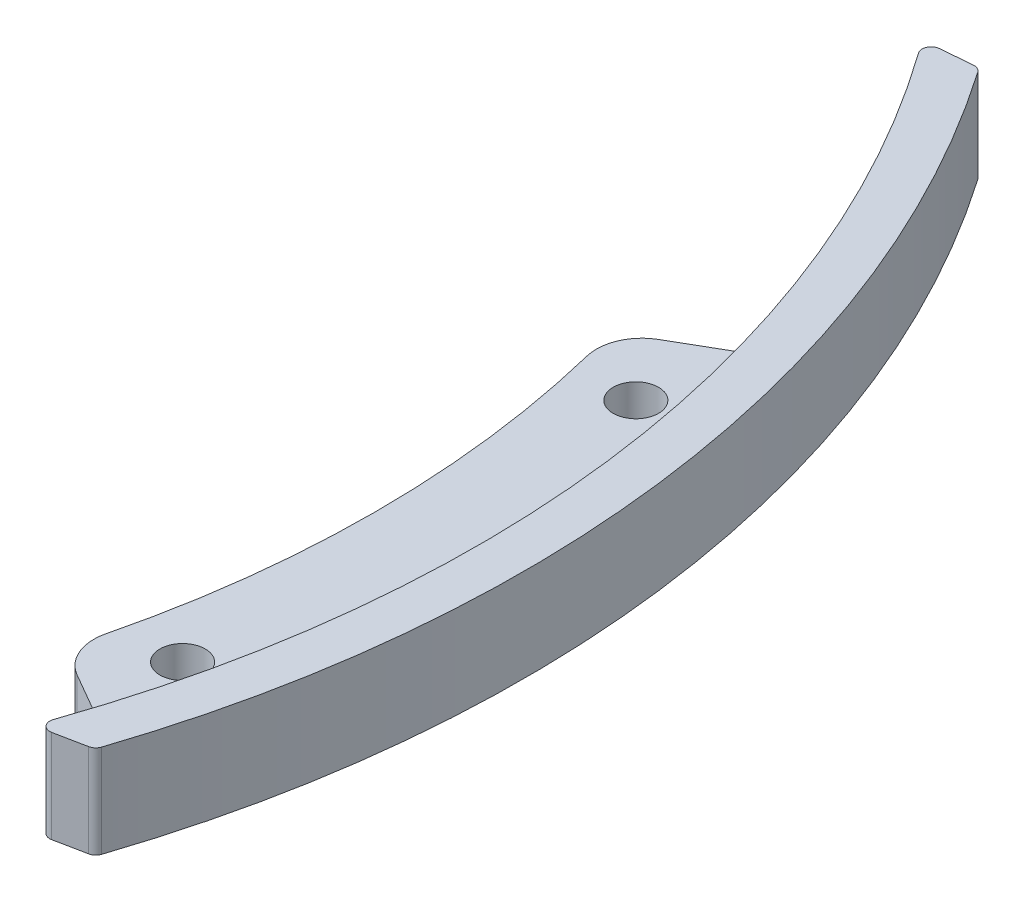
ISO-10303-21;
HEADER;
FILE_DESCRIPTION(('STEP AP214'),'2;1');
FILE_NAME('part.step','',(''),(''),'','','');
FILE_SCHEMA(('AUTOMOTIVE_DESIGN { 1 0 10303 214 1 1 1 1 }'));
ENDSEC;
DATA;
#1=APPLICATION_CONTEXT('core data for automotive mechanical design processes');
#2=APPLICATION_PROTOCOL_DEFINITION('international standard','automotive_design',2000,#1);
#3=PRODUCT_CONTEXT('',#1,'mechanical');
#4=PRODUCT('Part','Part','',(#3));
#5=PRODUCT_RELATED_PRODUCT_CATEGORY('part','',(#4));
#6=PRODUCT_DEFINITION_FORMATION('','',#4);
#7=PRODUCT_DEFINITION_CONTEXT('part definition',#1,'design');
#8=PRODUCT_DEFINITION('design','',#6,#7);
#9=PRODUCT_DEFINITION_SHAPE('','',#8);
#10=(LENGTH_UNIT() NAMED_UNIT(*) SI_UNIT(.MILLI.,.METRE.));
#11=(NAMED_UNIT(*) PLANE_ANGLE_UNIT() SI_UNIT($,.RADIAN.));
#12=(NAMED_UNIT(*) SI_UNIT($,.STERADIAN.) SOLID_ANGLE_UNIT());
#13=UNCERTAINTY_MEASURE_WITH_UNIT(LENGTH_MEASURE(1.E-05),#10,'distance_accuracy_value','');
#14=(GEOMETRIC_REPRESENTATION_CONTEXT(3) GLOBAL_UNCERTAINTY_ASSIGNED_CONTEXT((#13)) GLOBAL_UNIT_ASSIGNED_CONTEXT((#10,
#11,#12)) REPRESENTATION_CONTEXT('',''));
#15=CARTESIAN_POINT('',(0.,0.,0.));
#16=DIRECTION('',(0.,0.,1.));
#17=DIRECTION('',(1.,0.,0.));
#18=AXIS2_PLACEMENT_3D('',#15,#16,#17);
#19=CARTESIAN_POINT('',(0.,2.5,0.));
#20=DIRECTION('',(0.,1.,0.));
#21=DIRECTION('',(0.,0.,1.));
#22=AXIS2_PLACEMENT_3D('',#19,#20,#21);
#23=PLANE('',#22);
#24=CARTESIAN_POINT('',(114.80962503205,2.5,-25.));
#25=DIRECTION('',(0.,1.,0.));
#26=DIRECTION('',(0.,0.,1.));
#27=AXIS2_PLACEMENT_3D('',#24,#25,#26);
#28=CIRCLE('',#27,2.50000000000001);
#29=CARTESIAN_POINT('',(114.80962503205,2.5,-22.5));
#30=VERTEX_POINT('',#29);
#31=EDGE_CURVE('E261',#30,#30,#28,.T.);
#32=ORIENTED_EDGE('',*,*,#31,.F.);
#33=EDGE_LOOP('',(#32));
#34=FACE_BOUND('',#33,.T.);
#35=CARTESIAN_POINT('',(114.80962503205,2.5,25.));
#36=DIRECTION('',(0.,1.,0.));
#37=DIRECTION('',(0.,0.,1.));
#38=AXIS2_PLACEMENT_3D('',#35,#36,#37);
#39=CIRCLE('',#38,2.50000000000001);
#40=CARTESIAN_POINT('',(114.80962503205,2.5,27.5));
#41=VERTEX_POINT('',#40);
#42=EDGE_CURVE('E184',#41,#41,#39,.T.);
#43=ORIENTED_EDGE('',*,*,#42,.F.);
#44=EDGE_LOOP('',(#43));
#45=FACE_BOUND('',#44,.T.);
#46=CARTESIAN_POINT('',(0.,2.5,0.));
#47=DIRECTION('',(0.,1.,0.));
#48=DIRECTION('',(0.,0.,1.));
#49=AXIS2_PLACEMENT_3D('',#46,#47,#48);
#50=CIRCLE('',#49,111.1);
#51=CARTESIAN_POINT('',(107.884291904918,2.5,26.5365702413552));
#52=VERTEX_POINT('',#51);
#53=CARTESIAN_POINT('',(107.884291904918,2.5,-26.5365702413556));
#54=VERTEX_POINT('',#53);
#55=EDGE_CURVE('E252',#52,#54,#50,.T.);
#56=ORIENTED_EDGE('',*,*,#55,.F.);
#57=CARTESIAN_POINT('',(112.739570568506,2.5,27.7308353287249));
#58=DIRECTION('',(0.,1.,0.));
#59=DIRECTION('',(0.,0.,1.));
#60=AXIS2_PLACEMENT_3D('',#57,#58,#59);
#61=CIRCLE('',#60,5.);
#62=CARTESIAN_POINT('',(110.239570568506,2.5,32.0609623476471));
#63=VERTEX_POINT('',#62);
#64=EDGE_CURVE('E51',#52,#63,#61,.T.);
#65=ORIENTED_EDGE('',*,*,#64,.T.);
#66=DIRECTION('',(-0.866025403784437,0.,-0.500000000000003));
#67=VECTOR('',#66,1.);
#68=CARTESIAN_POINT('',(13.6770887107073,2.5,-23.6894125465716));
#69=LINE('',#68,#67);
#70=CARTESIAN_POINT('',(116.482793802061,2.5,35.6654889621512));
#71=VERTEX_POINT('',#70);
#72=EDGE_CURVE('E250',#71,#63,#69,.T.);
#73=ORIENTED_EDGE('',*,*,#72,.F.);
#74=CARTESIAN_POINT('',(115.982793802061,2.5,36.5315143659356));
#75=DIRECTION('',(0.,1.,0.));
#76=DIRECTION('',(0.,0.,1.));
#77=AXIS2_PLACEMENT_3D('',#74,#75,#76);
#78=CIRCLE('',#77,1.);
#79=CARTESIAN_POINT('',(116.936599672144,2.5,36.8319380038134));
#80=VERTEX_POINT('',#79);
#81=EDGE_CURVE('E232',#71,#80,#78,.F.);
#82=ORIENTED_EDGE('',*,*,#81,.T.);
#83=CARTESIAN_POINT('',(0.,2.5,0.));
#84=DIRECTION('',(0.,1.,0.));
#85=DIRECTION('',(0.,0.,1.));
#86=AXIS2_PLACEMENT_3D('',#83,#84,#85);
#87=CIRCLE('',#86,122.6);
#88=CARTESIAN_POINT('',(116.936599672144,2.5,-36.8319380038134));
#89=VERTEX_POINT('',#88);
#90=EDGE_CURVE('E277',#80,#89,#87,.T.);
#91=ORIENTED_EDGE('',*,*,#90,.T.);
#92=CARTESIAN_POINT('',(115.982793802061,2.5,-36.5315143659356));
#93=DIRECTION('',(0.,1.,0.));
#94=DIRECTION('',(0.,0.,1.));
#95=AXIS2_PLACEMENT_3D('',#92,#93,#94);
#96=CIRCLE('',#95,1.);
#97=CARTESIAN_POINT('',(116.482793802061,2.5,-35.6654889621512));
#98=VERTEX_POINT('',#97);
#99=EDGE_CURVE('E227',#89,#98,#96,.F.);
#100=ORIENTED_EDGE('',*,*,#99,.T.);
#101=DIRECTION('',(0.866025403784462,0.,-0.499999999999959));
#102=VECTOR('',#101,1.);
#103=CARTESIAN_POINT('',(13.6770887107031,2.5,23.6894125465671));
#104=LINE('',#103,#102);
#105=CARTESIAN_POINT('',(110.239570568506,2.5,-32.0609623476477));
#106=VERTEX_POINT('',#105);
#107=EDGE_CURVE('E284',#106,#98,#104,.T.);
#108=ORIENTED_EDGE('',*,*,#107,.F.);
#109=CARTESIAN_POINT('',(112.739570568506,2.5,-27.7308353287253));
#110=DIRECTION('',(0.,1.,0.));
#111=DIRECTION('',(0.,0.,1.));
#112=AXIS2_PLACEMENT_3D('',#109,#110,#111);
#113=CIRCLE('',#112,5.);
#114=EDGE_CURVE('E63',#106,#54,#113,.T.);
#115=ORIENTED_EDGE('',*,*,#114,.T.);
#116=EDGE_LOOP('',(#56,#65,#73,#82,#91,#100,#108,#115));
#117=FACE_BOUND('',#116,.T.);
#118=ADVANCED_FACE('F43',(#34,#45,#117),#23,.T.);
#119=CARTESIAN_POINT('',(0.,-2.5,0.));
#120=DIRECTION('',(0.,1.,0.));
#121=DIRECTION('',(0.,0.,1.));
#122=AXIS2_PLACEMENT_3D('',#119,#120,#121);
#123=PLANE('',#122);
#124=CARTESIAN_POINT('',(114.80962503205,-2.5,25.));
#125=DIRECTION('',(0.,1.,0.));
#126=DIRECTION('',(0.,0.,1.));
#127=AXIS2_PLACEMENT_3D('',#124,#125,#126);
#128=CIRCLE('',#127,2.50000000000001);
#129=CARTESIAN_POINT('',(114.80962503205,-2.5,27.5));
#130=VERTEX_POINT('',#129);
#131=EDGE_CURVE('E282',#130,#130,#128,.T.);
#132=ORIENTED_EDGE('',*,*,#131,.T.);
#133=EDGE_LOOP('',(#132));
#134=FACE_BOUND('',#133,.T.);
#135=CARTESIAN_POINT('',(114.80962503205,-2.5,-25.));
#136=DIRECTION('',(0.,1.,0.));
#137=DIRECTION('',(0.,0.,1.));
#138=AXIS2_PLACEMENT_3D('',#135,#136,#137);
#139=CIRCLE('',#138,2.50000000000001);
#140=CARTESIAN_POINT('',(114.80962503205,-2.5,-22.5));
#141=VERTEX_POINT('',#140);
#142=EDGE_CURVE('E275',#141,#141,#139,.T.);
#143=ORIENTED_EDGE('',*,*,#142,.T.);
#144=EDGE_LOOP('',(#143));
#145=FACE_BOUND('',#144,.T.);
#146=DIRECTION('',(-0.866025403784437,0.,-0.500000000000003));
#147=VECTOR('',#146,1.);
#148=CARTESIAN_POINT('',(13.6770887107073,-2.5,-23.6894125465716));
#149=LINE('',#148,#147);
#150=CARTESIAN_POINT('',(116.482793802061,-2.5,35.6654889621512));
#151=VERTEX_POINT('',#150);
#152=CARTESIAN_POINT('',(110.239570568506,-2.5,32.0609623476471));
#153=VERTEX_POINT('',#152);
#154=EDGE_CURVE('E269',#151,#153,#149,.T.);
#155=ORIENTED_EDGE('',*,*,#154,.T.);
#156=CARTESIAN_POINT('',(112.739570568506,-2.5,27.7308353287249));
#157=DIRECTION('',(0.,1.,0.));
#158=DIRECTION('',(0.,0.,1.));
#159=AXIS2_PLACEMENT_3D('',#156,#157,#158);
#160=CIRCLE('',#159,5.);
#161=CARTESIAN_POINT('',(107.884291904918,-2.5,26.5365702413552));
#162=VERTEX_POINT('',#161);
#163=EDGE_CURVE('E240',#153,#162,#160,.F.);
#164=ORIENTED_EDGE('',*,*,#163,.T.);
#165=CARTESIAN_POINT('',(0.,-2.5,0.));
#166=DIRECTION('',(0.,1.,0.));
#167=DIRECTION('',(0.,0.,1.));
#168=AXIS2_PLACEMENT_3D('',#165,#166,#167);
#169=CIRCLE('',#168,111.1);
#170=CARTESIAN_POINT('',(107.884291904918,-2.5,-26.5365702413556));
#171=VERTEX_POINT('',#170);
#172=EDGE_CURVE('E268',#162,#171,#169,.T.);
#173=ORIENTED_EDGE('',*,*,#172,.T.);
#174=CARTESIAN_POINT('',(112.739570568506,-2.5,-27.7308353287253));
#175=DIRECTION('',(0.,1.,0.));
#176=DIRECTION('',(0.,0.,1.));
#177=AXIS2_PLACEMENT_3D('',#174,#175,#176);
#178=CIRCLE('',#177,5.);
#179=CARTESIAN_POINT('',(110.239570568506,-2.5,-32.0609623476477));
#180=VERTEX_POINT('',#179);
#181=EDGE_CURVE('E238',#171,#180,#178,.F.);
#182=ORIENTED_EDGE('',*,*,#181,.T.);
#183=DIRECTION('',(0.866025403784462,0.,-0.499999999999959));
#184=VECTOR('',#183,1.);
#185=CARTESIAN_POINT('',(13.6770887107031,-2.5,23.6894125465671));
#186=LINE('',#185,#184);
#187=CARTESIAN_POINT('',(116.482793802061,-2.5,-35.6654889621512));
#188=VERTEX_POINT('',#187);
#189=EDGE_CURVE('E273',#180,#188,#186,.T.);
#190=ORIENTED_EDGE('',*,*,#189,.T.);
#191=CARTESIAN_POINT('',(115.982793802061,-2.5,-36.5315143659356));
#192=DIRECTION('',(0.,1.,0.));
#193=DIRECTION('',(0.,0.,1.));
#194=AXIS2_PLACEMENT_3D('',#191,#192,#193);
#195=CIRCLE('',#194,1.);
#196=CARTESIAN_POINT('',(116.936599672144,-2.5,-36.8319380038134));
#197=VERTEX_POINT('',#196);
#198=EDGE_CURVE('E224',#188,#197,#195,.T.);
#199=ORIENTED_EDGE('',*,*,#198,.T.);
#200=CARTESIAN_POINT('',(0.,-2.5,0.));
#201=DIRECTION('',(0.,1.,0.));
#202=DIRECTION('',(0.,0.,1.));
#203=AXIS2_PLACEMENT_3D('',#200,#201,#202);
#204=CIRCLE('',#203,122.6);
#205=CARTESIAN_POINT('',(116.936599672144,-2.5,36.8319380038134));
#206=VERTEX_POINT('',#205);
#207=EDGE_CURVE('E181',#206,#197,#204,.T.);
#208=ORIENTED_EDGE('',*,*,#207,.F.);
#209=CARTESIAN_POINT('',(115.982793802061,-2.5,36.5315143659356));
#210=DIRECTION('',(0.,1.,0.));
#211=DIRECTION('',(0.,0.,1.));
#212=AXIS2_PLACEMENT_3D('',#209,#210,#211);
#213=CIRCLE('',#212,1.);
#214=EDGE_CURVE('E230',#206,#151,#213,.T.);
#215=ORIENTED_EDGE('',*,*,#214,.T.);
#216=EDGE_LOOP('',(#155,#164,#173,#182,#190,#199,#208,#215));
#217=FACE_BOUND('',#216,.T.);
#218=ADVANCED_FACE('F267',(#134,#145,#217),#123,.F.);
#219=CARTESIAN_POINT('',(-5.48722699696259,2.5,-63.5635928805466));
#220=DIRECTION('',(-0.0860066927423597,0.,-0.996294559256208));
#221=DIRECTION('',(-0.996294559256208,0.,0.0860066927423597));
#222=AXIS2_PLACEMENT_3D('',#219,#220,#221);
#223=PLANE('',#222);
#224=DIRECTION('',(0.996294559256208,0.,-0.0860066927423597));
#225=VECTOR('',#224,1.);
#226=CARTESIAN_POINT('',(-5.48722699696259,5.125,-63.5635928805466));
#227=LINE('',#226,#225);
#228=CARTESIAN_POINT('',(100.575429946149,5.125,-72.7196183374703));
#229=VERTEX_POINT('',#228);
#230=CARTESIAN_POINT('',(104.031423908461,5.125,-73.017962444717));
#231=VERTEX_POINT('',#230);
#232=EDGE_CURVE('E393',#229,#231,#227,.T.);
#233=ORIENTED_EDGE('',*,*,#232,.T.);
#234=DIRECTION('',(0.,-1.,0.));
#235=VECTOR('',#234,1.);
#236=CARTESIAN_POINT('',(104.031423908461,2.5,-73.017962444717));
#237=LINE('',#236,#235);
#238=CARTESIAN_POINT('',(104.031423908461,-5.125,-73.017962444717));
#239=VERTEX_POINT('',#238);
#240=EDGE_CURVE('E176',#231,#239,#237,.T.);
#241=ORIENTED_EDGE('',*,*,#240,.T.);
#242=DIRECTION('',(0.996294559256208,0.,-0.0860066927423597));
#243=VECTOR('',#242,1.);
#244=CARTESIAN_POINT('',(-5.48722699696259,-5.125,-63.5635928805466));
#245=LINE('',#244,#243);
#246=CARTESIAN_POINT('',(100.575429946149,-5.125,-72.7196183374703));
#247=VERTEX_POINT('',#246);
#248=EDGE_CURVE('E159',#247,#239,#245,.T.);
#249=ORIENTED_EDGE('',*,*,#248,.F.);
#250=DIRECTION('',(0.,1.,0.));
#251=VECTOR('',#250,1.);
#252=CARTESIAN_POINT('',(100.575429946149,5.125,-72.7196183374703));
#253=LINE('',#252,#251);
#254=EDGE_CURVE('E173',#247,#229,#253,.T.);
#255=ORIENTED_EDGE('',*,*,#254,.T.);
#256=EDGE_LOOP('',(#233,#241,#249,#255));
#257=FACE_BOUND('',#256,.T.);
#258=ADVANCED_FACE('F172',(#257),#223,.T.);
#259=CARTESIAN_POINT('',(13.6770887107031,2.5,23.6894125465671));
#260=DIRECTION('',(-0.499999999999959,0.,-0.866025403784462));
#261=DIRECTION('',(-0.866025403784462,0.,0.499999999999959));
#262=AXIS2_PLACEMENT_3D('',#259,#260,#261);
#263=PLANE('',#262);
#264=ORIENTED_EDGE('',*,*,#189,.F.);
#265=DIRECTION('',(0.,-1.,0.));
#266=VECTOR('',#265,1.);
#267=CARTESIAN_POINT('',(110.239570568506,2.5,-32.0609623476477));
#268=LINE('',#267,#266);
#269=EDGE_CURVE('E11',#180,#106,#268,.F.);
#270=ORIENTED_EDGE('',*,*,#269,.T.);
#271=ORIENTED_EDGE('',*,*,#107,.T.);
#272=DIRECTION('',(0.,-1.,0.));
#273=VECTOR('',#272,1.);
#274=CARTESIAN_POINT('',(116.482793802061,2.5,-35.6654889621512));
#275=LINE('',#274,#273);
#276=EDGE_CURVE('E219',#98,#188,#275,.T.);
#277=ORIENTED_EDGE('',*,*,#276,.T.);
#278=EDGE_LOOP('',(#264,#270,#271,#277));
#279=FACE_BOUND('',#278,.T.);
#280=ADVANCED_FACE('F334',(#279),#263,.T.);
#281=CARTESIAN_POINT('',(0.,2.5,0.));
#282=DIRECTION('',(0.,-1.,0.));
#283=DIRECTION('',(0.,0.,-1.));
#284=AXIS2_PLACEMENT_3D('',#281,#282,#283);
#285=CYLINDRICAL_SURFACE('',#284,111.1);
#286=ORIENTED_EDGE('',*,*,#172,.F.);
#287=DIRECTION('',(0.,-1.,0.));
#288=VECTOR('',#287,1.);
#289=CARTESIAN_POINT('',(107.884291904918,2.5,26.5365702413552));
#290=LINE('',#289,#288);
#291=EDGE_CURVE('E245',#162,#52,#290,.F.);
#292=ORIENTED_EDGE('',*,*,#291,.T.);
#293=ORIENTED_EDGE('',*,*,#55,.T.);
#294=DIRECTION('',(0.,-1.,0.));
#295=VECTOR('',#294,1.);
#296=CARTESIAN_POINT('',(107.884291904918,2.5,-26.5365702413556));
#297=LINE('',#296,#295);
#298=EDGE_CURVE('E242',#54,#171,#297,.T.);
#299=ORIENTED_EDGE('',*,*,#298,.T.);
#300=EDGE_LOOP('',(#286,#292,#293,#299));
#301=FACE_BOUND('',#300,.T.);
#302=ADVANCED_FACE('F271',(#301),#285,.F.);
#303=CARTESIAN_POINT('',(13.6770887107073,2.5,-23.6894125465716));
#304=DIRECTION('',(-0.500000000000003,0.,0.866025403784437));
#305=DIRECTION('',(0.866025403784437,0.,0.500000000000003));
#306=AXIS2_PLACEMENT_3D('',#303,#304,#305);
#307=PLANE('',#306);
#308=ORIENTED_EDGE('',*,*,#72,.T.);
#309=DIRECTION('',(0.,-1.,0.));
#310=VECTOR('',#309,1.);
#311=CARTESIAN_POINT('',(110.239570568506,2.5,32.0609623476471));
#312=LINE('',#311,#310);
#313=EDGE_CURVE('E235',#63,#153,#312,.T.);
#314=ORIENTED_EDGE('',*,*,#313,.T.);
#315=ORIENTED_EDGE('',*,*,#154,.F.);
#316=DIRECTION('',(0.,-1.,0.));
#317=VECTOR('',#316,1.);
#318=CARTESIAN_POINT('',(116.482793802061,2.5,35.6654889621512));
#319=LINE('',#318,#317);
#320=EDGE_CURVE('E222',#151,#71,#319,.F.);
#321=ORIENTED_EDGE('',*,*,#320,.T.);
#322=EDGE_LOOP('',(#308,#314,#315,#321));
#323=FACE_BOUND('',#322,.T.);
#324=ADVANCED_FACE('F257',(#323),#307,.T.);
#325=CARTESIAN_POINT('',(0.,2.5,0.));
#326=DIRECTION('',(0.,-1.,0.));
#327=DIRECTION('',(0.,0.,-1.));
#328=AXIS2_PLACEMENT_3D('',#325,#326,#327);
#329=CYLINDRICAL_SURFACE('',#328,122.6);
#330=CARTESIAN_POINT('',(0.,-5.125,0.));
#331=DIRECTION('',(0.,1.,0.));
#332=DIRECTION('',(0.,0.,1.));
#333=AXIS2_PLACEMENT_3D('',#330,#331,#332);
#334=CIRCLE('',#333,122.6);
#335=CARTESIAN_POINT('',(99.8470237211006,-5.125,-71.1430379871283));
#336=VERTEX_POINT('',#335);
#337=CARTESIAN_POINT('',(115.801184089958,-5.125,40.2597288039002));
#338=VERTEX_POINT('',#337);
#339=EDGE_CURVE('E161',#336,#338,#334,.F.);
#340=ORIENTED_EDGE('',*,*,#339,.T.);
#341=DIRECTION('',(0.,-1.,0.));
#342=VECTOR('',#341,1.);
#343=CARTESIAN_POINT('',(115.801184089958,2.5,40.2597288039002));
#344=LINE('',#343,#342);
#345=CARTESIAN_POINT('',(115.801184089958,5.125,40.2597288039002));
#346=VERTEX_POINT('',#345);
#347=EDGE_CURVE('E217',#338,#346,#344,.F.);
#348=ORIENTED_EDGE('',*,*,#347,.T.);
#349=CARTESIAN_POINT('',(0.,5.125,0.));
#350=DIRECTION('',(0.,1.,0.));
#351=DIRECTION('',(0.,0.,1.));
#352=AXIS2_PLACEMENT_3D('',#349,#350,#351);
#353=CIRCLE('',#352,122.6);
#354=CARTESIAN_POINT('',(99.8470237211006,5.125,-71.1430379871283));
#355=VERTEX_POINT('',#354);
#356=EDGE_CURVE('E384',#355,#346,#353,.F.);
#357=ORIENTED_EDGE('',*,*,#356,.F.);
#358=DIRECTION('',(0.,-1.,0.));
#359=VECTOR('',#358,1.);
#360=CARTESIAN_POINT('',(99.8470237211006,2.5,-71.1430379871283));
#361=LINE('',#360,#359);
#362=EDGE_CURVE('E215',#355,#336,#361,.T.);
#363=ORIENTED_EDGE('',*,*,#362,.T.);
#364=EDGE_LOOP('',(#340,#348,#357,#363));
#365=FACE_BOUND('',#364,.T.);
#366=ORIENTED_EDGE('',*,*,#207,.T.);
#367=DIRECTION('',(0.,-1.,0.));
#368=VECTOR('',#367,1.);
#369=CARTESIAN_POINT('',(116.936599672144,2.5,-36.8319380038134));
#370=LINE('',#369,#368);
#371=EDGE_CURVE('E212',#197,#89,#370,.F.);
#372=ORIENTED_EDGE('',*,*,#371,.T.);
#373=ORIENTED_EDGE('',*,*,#90,.F.);
#374=DIRECTION('',(0.,-1.,0.));
#375=VECTOR('',#374,1.);
#376=CARTESIAN_POINT('',(116.936599672144,2.5,36.8319380038134));
#377=LINE('',#376,#375);
#378=EDGE_CURVE('E209',#80,#206,#377,.T.);
#379=ORIENTED_EDGE('',*,*,#378,.T.);
#380=EDGE_LOOP('',(#366,#372,#373,#379));
#381=FACE_BOUND('',#380,.T.);
#382=ADVANCED_FACE('F325',(#365,#381),#329,.F.);
#383=CARTESIAN_POINT('',(12.5735149110095,2.5,62.5487547660431));
#384=DIRECTION('',(-0.197077036222721,0.,-0.980388005737355));
#385=DIRECTION('',(-0.980388005737355,0.,0.197077036222721));
#386=AXIS2_PLACEMENT_3D('',#383,#384,#385);
#387=PLANE('',#386);
#388=DIRECTION('',(0.980388005737355,0.,-0.197077036222721));
#389=VECTOR('',#388,1.);
#390=CARTESIAN_POINT('',(12.5735149110095,5.125,62.5487547660431));
#391=LINE('',#390,#389);
#392=CARTESIAN_POINT('',(116.942805857747,5.125,41.568499589441));
#393=VERTEX_POINT('',#392);
#394=CARTESIAN_POINT('',(120.343622410515,5.125,40.8848693909537));
#395=VERTEX_POINT('',#394);
#396=EDGE_CURVE('E379',#393,#395,#391,.T.);
#397=ORIENTED_EDGE('',*,*,#396,.F.);
#398=DIRECTION('',(0.,-1.,0.));
#399=VECTOR('',#398,1.);
#400=CARTESIAN_POINT('',(116.942805857747,2.5,41.568499589441));
#401=LINE('',#400,#399);
#402=CARTESIAN_POINT('',(116.942805857747,-5.125,41.568499589441));
#403=VERTEX_POINT('',#402);
#404=EDGE_CURVE('E206',#393,#403,#401,.T.);
#405=ORIENTED_EDGE('',*,*,#404,.T.);
#406=DIRECTION('',(0.980388005737355,0.,-0.197077036222721));
#407=VECTOR('',#406,1.);
#408=CARTESIAN_POINT('',(12.5735149110095,-5.125,62.5487547660431));
#409=LINE('',#408,#407);
#410=CARTESIAN_POINT('',(120.343622410515,-5.125,40.8848693909537));
#411=VERTEX_POINT('',#410);
#412=EDGE_CURVE('E389',#403,#411,#409,.T.);
#413=ORIENTED_EDGE('',*,*,#412,.T.);
#414=DIRECTION('',(0.,1.,0.));
#415=VECTOR('',#414,1.);
#416=CARTESIAN_POINT('',(120.343622410515,5.125,40.8848693909537));
#417=LINE('',#416,#415);
#418=EDGE_CURVE('E204',#411,#395,#417,.T.);
#419=ORIENTED_EDGE('',*,*,#418,.T.);
#420=EDGE_LOOP('',(#397,#405,#413,#419));
#421=FACE_BOUND('',#420,.T.);
#422=ADVANCED_FACE('F318',(#421),#387,.F.);
#423=CARTESIAN_POINT('',(114.80962503205,2.5,-25.));
#424=DIRECTION('',(0.,-1.,0.));
#425=DIRECTION('',(0.,0.,-1.));
#426=AXIS2_PLACEMENT_3D('',#423,#424,#425);
#427=CYLINDRICAL_SURFACE('',#426,2.50000000000001);
#428=ORIENTED_EDGE('',*,*,#31,.T.);
#429=EDGE_LOOP('',(#428));
#430=FACE_BOUND('',#429,.T.);
#431=ORIENTED_EDGE('',*,*,#142,.F.);
#432=EDGE_LOOP('',(#431));
#433=FACE_BOUND('',#432,.T.);
#434=ADVANCED_FACE('F315',(#430,#433),#427,.F.);
#435=CARTESIAN_POINT('',(0.,2.5,0.));
#436=DIRECTION('',(0.,-1.,0.));
#437=DIRECTION('',(0.,0.,-1.));
#438=AXIS2_PLACEMENT_3D('',#435,#436,#437);
#439=CYLINDRICAL_SURFACE('',#438,127.6);
#440=CARTESIAN_POINT('',(0.,-5.125,0.));
#441=DIRECTION('',(0.,1.,0.));
#442=DIRECTION('',(0.,0.,1.));
#443=AXIS2_PLACEMENT_3D('',#440,#441,#442);
#444=CIRCLE('',#443,127.6);
#445=CARTESIAN_POINT('',(104.939843165194,-5.125,-72.5905594169416));
#446=VERTEX_POINT('',#445);
#447=CARTESIAN_POINT('',(121.095570219271,-5.125,40.2196826599811));
#448=VERTEX_POINT('',#447);
#449=EDGE_CURVE('E391',#446,#448,#444,.F.);
#450=ORIENTED_EDGE('',*,*,#449,.F.);
#451=DIRECTION('',(0.,-1.,0.));
#452=VECTOR('',#451,1.);
#453=CARTESIAN_POINT('',(104.939843165194,2.5,-72.5905594169416));
#454=LINE('',#453,#452);
#455=CARTESIAN_POINT('',(104.939843165194,5.125,-72.5905594169416));
#456=VERTEX_POINT('',#455);
#457=EDGE_CURVE('E195',#446,#456,#454,.F.);
#458=ORIENTED_EDGE('',*,*,#457,.T.);
#459=CARTESIAN_POINT('',(0.,5.125,0.));
#460=DIRECTION('',(0.,1.,0.));
#461=DIRECTION('',(0.,0.,1.));
#462=AXIS2_PLACEMENT_3D('',#459,#460,#461);
#463=CIRCLE('',#462,127.6);
#464=CARTESIAN_POINT('',(121.095570219271,5.125,40.2196826599811));
#465=VERTEX_POINT('',#464);
#466=EDGE_CURVE('E377',#456,#465,#463,.F.);
#467=ORIENTED_EDGE('',*,*,#466,.T.);
#468=DIRECTION('',(0.,-1.,0.));
#469=VECTOR('',#468,1.);
#470=CARTESIAN_POINT('',(121.095570219271,2.5,40.2196826599811));
#471=LINE('',#470,#469);
#472=EDGE_CURVE('E192',#465,#448,#471,.T.);
#473=ORIENTED_EDGE('',*,*,#472,.T.);
#474=EDGE_LOOP('',(#450,#458,#467,#473));
#475=FACE_BOUND('',#474,.T.);
#476=ADVANCED_FACE('F314',(#475),#439,.T.);
#477=CARTESIAN_POINT('',(114.80962503205,2.5,25.));
#478=DIRECTION('',(0.,-1.,0.));
#479=DIRECTION('',(0.,0.,-1.));
#480=AXIS2_PLACEMENT_3D('',#477,#478,#479);
#481=CYLINDRICAL_SURFACE('',#480,2.50000000000001);
#482=ORIENTED_EDGE('',*,*,#42,.T.);
#483=EDGE_LOOP('',(#482));
#484=FACE_BOUND('',#483,.T.);
#485=ORIENTED_EDGE('',*,*,#131,.F.);
#486=EDGE_LOOP('',(#485));
#487=FACE_BOUND('',#486,.T.);
#488=ADVANCED_FACE('F296',(#484,#487),#481,.F.);
#489=CARTESIAN_POINT('',(0.,-5.125,0.));
#490=DIRECTION('',(0.,1.,0.));
#491=DIRECTION('',(0.,0.,1.));
#492=AXIS2_PLACEMENT_3D('',#489,#490,#491);
#493=PLANE('',#492);
#494=ORIENTED_EDGE('',*,*,#248,.T.);
#495=CARTESIAN_POINT('',(104.117430601203,-5.125,-72.0216678854608));
#496=DIRECTION('',(0.,1.,0.));
#497=DIRECTION('',(0.,0.,1.));
#498=AXIS2_PLACEMENT_3D('',#495,#496,#497);
#499=CIRCLE('',#498,1.);
#500=EDGE_CURVE('E190',#239,#446,#499,.F.);
#501=ORIENTED_EDGE('',*,*,#500,.T.);
#502=ORIENTED_EDGE('',*,*,#449,.T.);
#503=CARTESIAN_POINT('',(120.146545374292,-5.125,39.9044813852164));
#504=DIRECTION('',(0.,1.,0.));
#505=DIRECTION('',(0.,0.,1.));
#506=AXIS2_PLACEMENT_3D('',#503,#504,#505);
#507=CIRCLE('',#506,1.);
#508=EDGE_CURVE('E167',#448,#411,#507,.F.);
#509=ORIENTED_EDGE('',*,*,#508,.T.);
#510=ORIENTED_EDGE('',*,*,#412,.F.);
#511=CARTESIAN_POINT('',(116.745728821524,-5.125,40.5881115837037));
#512=DIRECTION('',(0.,1.,0.));
#513=DIRECTION('',(0.,0.,1.));
#514=AXIS2_PLACEMENT_3D('',#511,#512,#513);
#515=CIRCLE('',#514,1.);
#516=EDGE_CURVE('E166',#403,#338,#515,.F.);
#517=ORIENTED_EDGE('',*,*,#516,.T.);
#518=ORIENTED_EDGE('',*,*,#339,.F.);
#519=CARTESIAN_POINT('',(100.661436638891,-5.125,-71.7233237782141));
#520=DIRECTION('',(0.,1.,0.));
#521=DIRECTION('',(0.,0.,1.));
#522=AXIS2_PLACEMENT_3D('',#519,#520,#521);
#523=CIRCLE('',#522,1.);
#524=EDGE_CURVE('E156',#336,#247,#523,.F.);
#525=ORIENTED_EDGE('',*,*,#524,.T.);
#526=EDGE_LOOP('',(#494,#501,#502,#509,#510,#517,#518,#525));
#527=FACE_BOUND('',#526,.T.);
#528=ADVANCED_FACE('F158',(#527),#493,.F.);
#529=CARTESIAN_POINT('',(0.,5.125,0.));
#530=DIRECTION('',(0.,1.,0.));
#531=DIRECTION('',(0.,0.,1.));
#532=AXIS2_PLACEMENT_3D('',#529,#530,#531);
#533=PLANE('',#532);
#534=ORIENTED_EDGE('',*,*,#466,.F.);
#535=CARTESIAN_POINT('',(104.117430601203,5.125,-72.0216678854608));
#536=DIRECTION('',(0.,1.,0.));
#537=DIRECTION('',(0.,0.,1.));
#538=AXIS2_PLACEMENT_3D('',#535,#536,#537);
#539=CIRCLE('',#538,1.);
#540=EDGE_CURVE('E202',#456,#231,#539,.T.);
#541=ORIENTED_EDGE('',*,*,#540,.T.);
#542=ORIENTED_EDGE('',*,*,#232,.F.);
#543=CARTESIAN_POINT('',(100.661436638891,5.125,-71.7233237782141));
#544=DIRECTION('',(0.,1.,0.));
#545=DIRECTION('',(0.,0.,1.));
#546=AXIS2_PLACEMENT_3D('',#543,#544,#545);
#547=CIRCLE('',#546,1.);
#548=EDGE_CURVE('E180',#229,#355,#547,.T.);
#549=ORIENTED_EDGE('',*,*,#548,.T.);
#550=ORIENTED_EDGE('',*,*,#356,.T.);
#551=CARTESIAN_POINT('',(116.745728821524,5.125,40.5881115837037));
#552=DIRECTION('',(0.,1.,0.));
#553=DIRECTION('',(0.,0.,1.));
#554=AXIS2_PLACEMENT_3D('',#551,#552,#553);
#555=CIRCLE('',#554,1.);
#556=EDGE_CURVE('E200',#346,#393,#555,.T.);
#557=ORIENTED_EDGE('',*,*,#556,.T.);
#558=ORIENTED_EDGE('',*,*,#396,.T.);
#559=CARTESIAN_POINT('',(120.146545374292,5.125,39.9044813852164));
#560=DIRECTION('',(0.,1.,0.));
#561=DIRECTION('',(0.,0.,1.));
#562=AXIS2_PLACEMENT_3D('',#559,#560,#561);
#563=CIRCLE('',#562,1.);
#564=EDGE_CURVE('E197',#395,#465,#563,.T.);
#565=ORIENTED_EDGE('',*,*,#564,.T.);
#566=EDGE_LOOP('',(#534,#541,#542,#549,#550,#557,#558,#565));
#567=FACE_BOUND('',#566,.T.);
#568=ADVANCED_FACE('F343',(#567),#533,.T.);
#569=CARTESIAN_POINT('',(104.117430601203,2.5,-72.0216678854608));
#570=DIRECTION('',(0.,-1.,0.));
#571=DIRECTION('',(0.,0.,-1.));
#572=AXIS2_PLACEMENT_3D('',#569,#570,#571);
#573=CYLINDRICAL_SURFACE('',#572,1.);
#574=ORIENTED_EDGE('',*,*,#540,.F.);
#575=ORIENTED_EDGE('',*,*,#457,.F.);
#576=ORIENTED_EDGE('',*,*,#500,.F.);
#577=ORIENTED_EDGE('',*,*,#240,.F.);
#578=EDGE_LOOP('',(#574,#575,#576,#577));
#579=FACE_BOUND('',#578,.T.);
#580=ADVANCED_FACE('F339',(#579),#573,.T.);
#581=CARTESIAN_POINT('',(116.745728821524,2.5,40.5881115837037));
#582=DIRECTION('',(0.,-1.,0.));
#583=DIRECTION('',(0.,0.,-1.));
#584=AXIS2_PLACEMENT_3D('',#581,#582,#583);
#585=CYLINDRICAL_SURFACE('',#584,1.);
#586=ORIENTED_EDGE('',*,*,#556,.F.);
#587=ORIENTED_EDGE('',*,*,#347,.F.);
#588=ORIENTED_EDGE('',*,*,#516,.F.);
#589=ORIENTED_EDGE('',*,*,#404,.F.);
#590=EDGE_LOOP('',(#586,#587,#588,#589));
#591=FACE_BOUND('',#590,.T.);
#592=ADVANCED_FACE('F342',(#591),#585,.T.);
#593=CARTESIAN_POINT('',(100.661436638891,2.5,-71.7233237782141));
#594=DIRECTION('',(0.,-1.,0.));
#595=DIRECTION('',(0.,0.,-1.));
#596=AXIS2_PLACEMENT_3D('',#593,#594,#595);
#597=CYLINDRICAL_SURFACE('',#596,1.);
#598=ORIENTED_EDGE('',*,*,#548,.F.);
#599=ORIENTED_EDGE('',*,*,#254,.F.);
#600=ORIENTED_EDGE('',*,*,#524,.F.);
#601=ORIENTED_EDGE('',*,*,#362,.F.);
#602=EDGE_LOOP('',(#598,#599,#600,#601));
#603=FACE_BOUND('',#602,.T.);
#604=ADVANCED_FACE('F179',(#603),#597,.T.);
#605=CARTESIAN_POINT('',(120.146545374292,2.5,39.9044813852164));
#606=DIRECTION('',(0.,-1.,0.));
#607=DIRECTION('',(0.,0.,-1.));
#608=AXIS2_PLACEMENT_3D('',#605,#606,#607);
#609=CYLINDRICAL_SURFACE('',#608,1.);
#610=ORIENTED_EDGE('',*,*,#564,.F.);
#611=ORIENTED_EDGE('',*,*,#418,.F.);
#612=ORIENTED_EDGE('',*,*,#508,.F.);
#613=ORIENTED_EDGE('',*,*,#472,.F.);
#614=EDGE_LOOP('',(#610,#611,#612,#613));
#615=FACE_BOUND('',#614,.T.);
#616=ADVANCED_FACE('F350',(#615),#609,.T.);
#617=CARTESIAN_POINT('',(115.982793802061,2.5,-36.5315143659356));
#618=DIRECTION('',(0.,-1.,0.));
#619=DIRECTION('',(0.,0.,-1.));
#620=AXIS2_PLACEMENT_3D('',#617,#618,#619);
#621=CYLINDRICAL_SURFACE('',#620,1.);
#622=ORIENTED_EDGE('',*,*,#99,.F.);
#623=ORIENTED_EDGE('',*,*,#371,.F.);
#624=ORIENTED_EDGE('',*,*,#198,.F.);
#625=ORIENTED_EDGE('',*,*,#276,.F.);
#626=EDGE_LOOP('',(#622,#623,#624,#625));
#627=FACE_BOUND('',#626,.T.);
#628=ADVANCED_FACE('F353',(#627),#621,.F.);
#629=CARTESIAN_POINT('',(115.982793802061,2.5,36.5315143659356));
#630=DIRECTION('',(0.,-1.,0.));
#631=DIRECTION('',(0.,0.,-1.));
#632=AXIS2_PLACEMENT_3D('',#629,#630,#631);
#633=CYLINDRICAL_SURFACE('',#632,1.);
#634=ORIENTED_EDGE('',*,*,#81,.F.);
#635=ORIENTED_EDGE('',*,*,#320,.F.);
#636=ORIENTED_EDGE('',*,*,#214,.F.);
#637=ORIENTED_EDGE('',*,*,#378,.F.);
#638=EDGE_LOOP('',(#634,#635,#636,#637));
#639=FACE_BOUND('',#638,.T.);
#640=ADVANCED_FACE('F357',(#639),#633,.F.);
#641=CARTESIAN_POINT('',(112.739570568506,2.5,27.7308353287249));
#642=DIRECTION('',(0.,-1.,0.));
#643=DIRECTION('',(0.,0.,-1.));
#644=AXIS2_PLACEMENT_3D('',#641,#642,#643);
#645=CYLINDRICAL_SURFACE('',#644,5.);
#646=ORIENTED_EDGE('',*,*,#64,.F.);
#647=ORIENTED_EDGE('',*,*,#291,.F.);
#648=ORIENTED_EDGE('',*,*,#163,.F.);
#649=ORIENTED_EDGE('',*,*,#313,.F.);
#650=EDGE_LOOP('',(#646,#647,#648,#649));
#651=FACE_BOUND('',#650,.T.);
#652=ADVANCED_FACE('F263',(#651),#645,.T.);
#653=CARTESIAN_POINT('',(112.739570568506,2.5,-27.7308353287253));
#654=DIRECTION('',(0.,-1.,0.));
#655=DIRECTION('',(0.,0.,-1.));
#656=AXIS2_PLACEMENT_3D('',#653,#654,#655);
#657=CYLINDRICAL_SURFACE('',#656,5.);
#658=ORIENTED_EDGE('',*,*,#114,.F.);
#659=ORIENTED_EDGE('',*,*,#269,.F.);
#660=ORIENTED_EDGE('',*,*,#181,.F.);
#661=ORIENTED_EDGE('',*,*,#298,.F.);
#662=EDGE_LOOP('',(#658,#659,#660,#661));
#663=FACE_BOUND('',#662,.T.);
#664=ADVANCED_FACE('F45',(#663),#657,.T.);
#665=CLOSED_SHELL('',(#118,#218,#258,#280,#302,#324,#382,#422,#434,#476,#488,#528,#568,#580,
#592,#604,#616,#628,#640,#652,#664));
#666=MANIFOLD_SOLID_BREP('B2',#665);
#667=ADVANCED_BREP_SHAPE_REPRESENTATION('',(#18,#666),#14);
#668=SHAPE_DEFINITION_REPRESENTATION(#9,#667);
ENDSEC;
END-ISO-10303-21;
